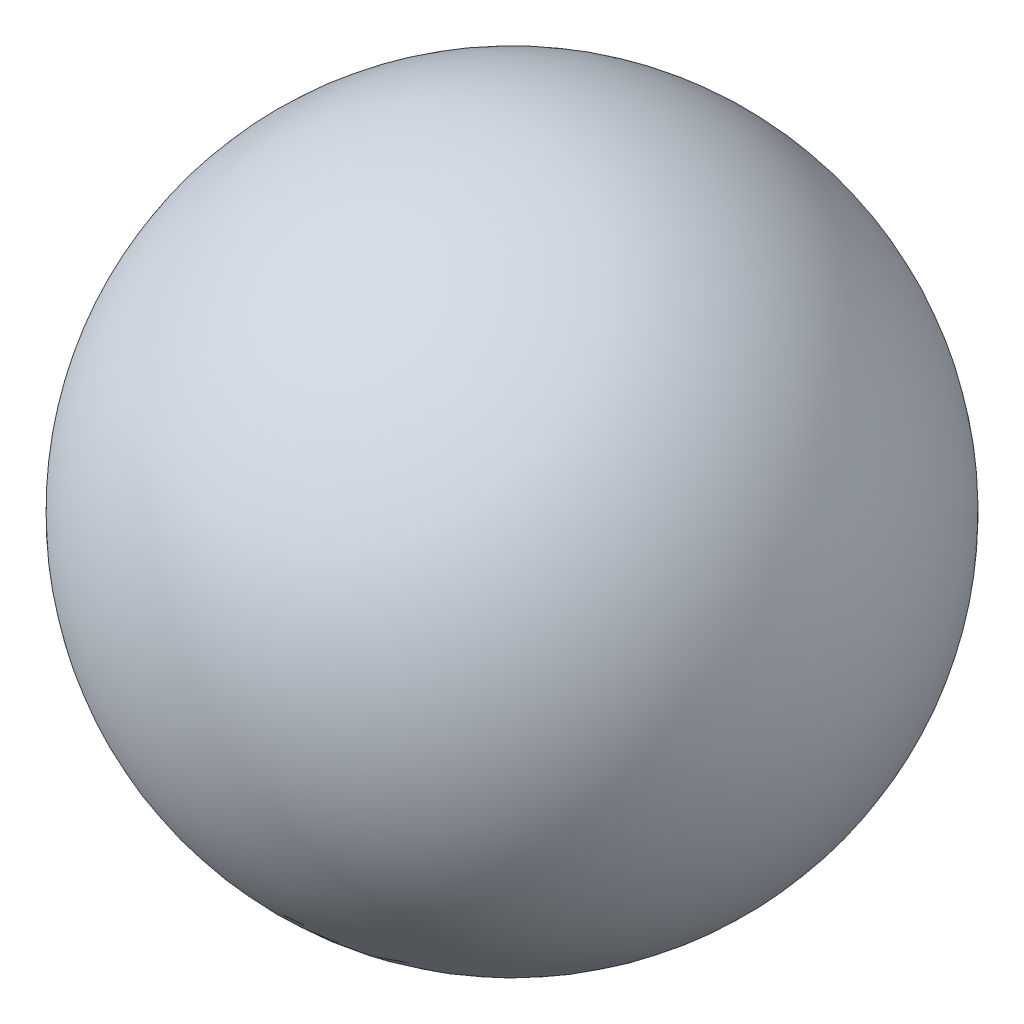
ISO-10303-21;
HEADER;
FILE_DESCRIPTION(('STEP AP214'),'2;1');
FILE_NAME('part.step','',(''),(''),'','','');
FILE_SCHEMA(('AUTOMOTIVE_DESIGN { 1 0 10303 214 1 1 1 1 }'));
ENDSEC;
DATA;
#1=APPLICATION_CONTEXT('core data for automotive mechanical design processes');
#2=APPLICATION_PROTOCOL_DEFINITION('international standard','automotive_design',2000,#1);
#3=PRODUCT_CONTEXT('',#1,'mechanical');
#4=PRODUCT('Part','Part','',(#3));
#5=PRODUCT_RELATED_PRODUCT_CATEGORY('part','',(#4));
#6=PRODUCT_DEFINITION_FORMATION('','',#4);
#7=PRODUCT_DEFINITION_CONTEXT('part definition',#1,'design');
#8=PRODUCT_DEFINITION('design','',#6,#7);
#9=PRODUCT_DEFINITION_SHAPE('','',#8);
#10=(LENGTH_UNIT() NAMED_UNIT(*) SI_UNIT(.MILLI.,.METRE.));
#11=(NAMED_UNIT(*) PLANE_ANGLE_UNIT() SI_UNIT($,.RADIAN.));
#12=(NAMED_UNIT(*) SI_UNIT($,.STERADIAN.) SOLID_ANGLE_UNIT());
#13=UNCERTAINTY_MEASURE_WITH_UNIT(LENGTH_MEASURE(1.E-05),#10,'distance_accuracy_value','');
#14=(GEOMETRIC_REPRESENTATION_CONTEXT(3) GLOBAL_UNCERTAINTY_ASSIGNED_CONTEXT((#13)) GLOBAL_UNIT_ASSIGNED_CONTEXT((#10,
#11,#12)) REPRESENTATION_CONTEXT('',''));
#15=CARTESIAN_POINT('',(0.,0.,0.));
#16=DIRECTION('',(0.,0.,1.));
#17=DIRECTION('',(1.,0.,0.));
#18=AXIS2_PLACEMENT_3D('',#15,#16,#17);
#19=CARTESIAN_POINT('',(64.16,43.3154351678161,54.2012339824728));
#20=DIRECTION('',(0.,0.624294642316078,0.781188965344144));
#21=DIRECTION('',(0.173648177666935,-0.769320949638492,0.614810203916852));
#22=AXIS2_PLACEMENT_3D('',#19,#20,#21);
#23=SPHERICAL_SURFACE('',#22,7.15);
#24=CARTESIAN_POINT('',(64.16,47.7791418603775,59.7867350846834));
#25=VERTEX_POINT('',#24);
#26=VERTEX_LOOP('',#25);
#27=FACE_BOUND('',#26,.T.);
#28=CARTESIAN_POINT('',(64.16,38.8517284752562,48.6157328802622));
#29=VERTEX_POINT('',#28);
#30=VERTEX_LOOP('',#29);
#31=FACE_BOUND('',#30,.T.);
#32=ADVANCED_FACE('F15',(#27,#31),#23,.T.);
#33=CLOSED_SHELL('',(#32));
#34=MANIFOLD_SOLID_BREP('B1',#33);
#35=ADVANCED_BREP_SHAPE_REPRESENTATION('',(#18,#34),#14);
#36=SHAPE_DEFINITION_REPRESENTATION(#9,#35);
ENDSEC;
END-ISO-10303-21;
